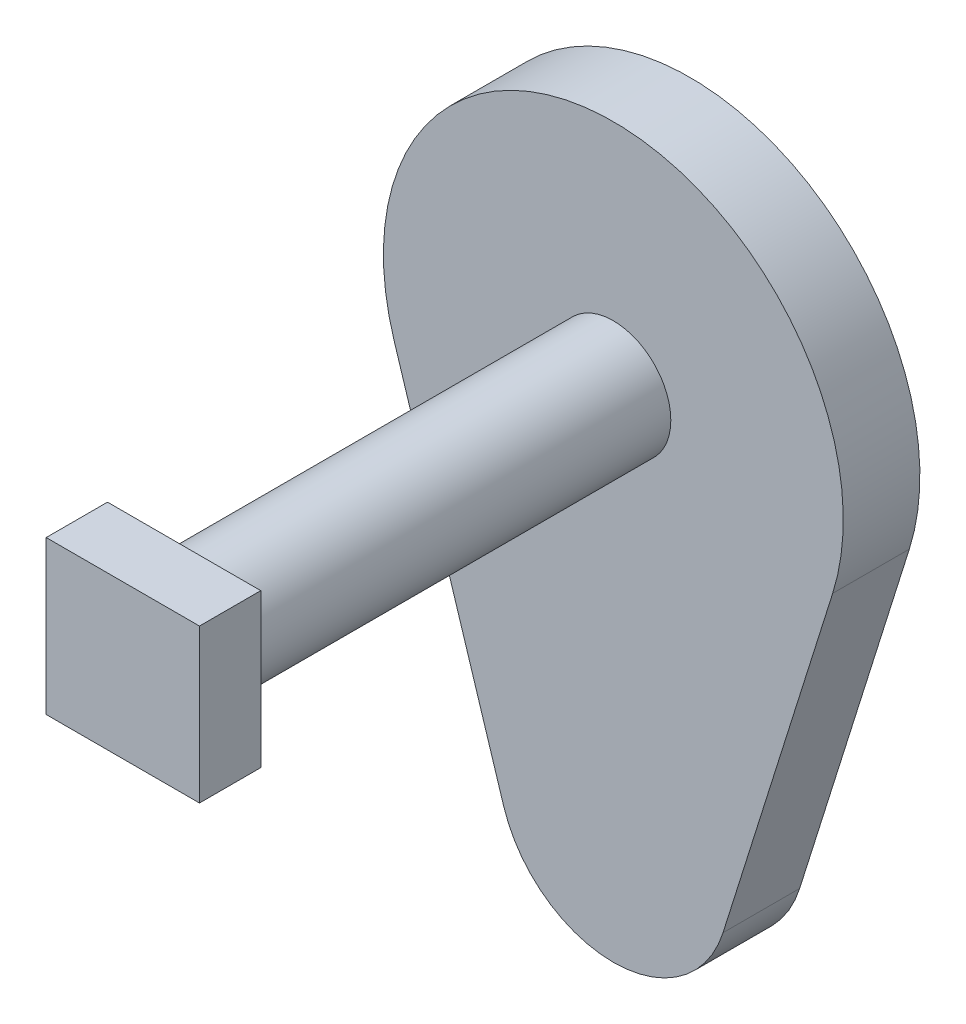
ISO-10303-21;
HEADER;
FILE_DESCRIPTION(('STEP AP214'),'2;1');
FILE_NAME('part.step','',(''),(''),'','','');
FILE_SCHEMA(('AUTOMOTIVE_DESIGN { 1 0 10303 214 1 1 1 1 }'));
ENDSEC;
DATA;
#1=APPLICATION_CONTEXT('core data for automotive mechanical design processes');
#2=APPLICATION_PROTOCOL_DEFINITION('international standard','automotive_design',2000,#1);
#3=PRODUCT_CONTEXT('',#1,'mechanical');
#4=PRODUCT('Part','Part','',(#3));
#5=PRODUCT_RELATED_PRODUCT_CATEGORY('part','',(#4));
#6=PRODUCT_DEFINITION_FORMATION('','',#4);
#7=PRODUCT_DEFINITION_CONTEXT('part definition',#1,'design');
#8=PRODUCT_DEFINITION('design','',#6,#7);
#9=PRODUCT_DEFINITION_SHAPE('','',#8);
#10=(LENGTH_UNIT() NAMED_UNIT(*) SI_UNIT(.MILLI.,.METRE.));
#11=(NAMED_UNIT(*) PLANE_ANGLE_UNIT() SI_UNIT($,.RADIAN.));
#12=(NAMED_UNIT(*) SI_UNIT($,.STERADIAN.) SOLID_ANGLE_UNIT());
#13=UNCERTAINTY_MEASURE_WITH_UNIT(LENGTH_MEASURE(1.E-05),#10,'distance_accuracy_value','');
#14=(GEOMETRIC_REPRESENTATION_CONTEXT(3) GLOBAL_UNCERTAINTY_ASSIGNED_CONTEXT((#13)) GLOBAL_UNIT_ASSIGNED_CONTEXT((#10,
#11,#12)) REPRESENTATION_CONTEXT('',''));
#15=CARTESIAN_POINT('',(0.,0.,0.));
#16=DIRECTION('',(0.,0.,1.));
#17=DIRECTION('',(1.,0.,0.));
#18=AXIS2_PLACEMENT_3D('',#15,#16,#17);
#19=CARTESIAN_POINT('',(-3.66720542821497E-11,50.,10.));
#20=DIRECTION('',(0.,0.,-1.));
#21=DIRECTION('',(-1.,0.,0.));
#22=AXIS2_PLACEMENT_3D('',#19,#20,#21);
#23=CYLINDRICAL_SURFACE('',#22,30.);
#24=CARTESIAN_POINT('',(-3.66720542821497E-11,50.,0.));
#25=DIRECTION('',(0.,0.,1.));
#26=DIRECTION('',(1.,0.,0.));
#27=AXIS2_PLACEMENT_3D('',#24,#25,#26);
#28=CIRCLE('',#27,30.);
#29=CARTESIAN_POINT('',(28.6181760424783,41.000000000021,0.));
#30=VERTEX_POINT('',#29);
#31=CARTESIAN_POINT('',(-28.6181760425384,40.999999999979,0.));
#32=VERTEX_POINT('',#31);
#33=EDGE_CURVE('E140',#30,#32,#28,.T.);
#34=ORIENTED_EDGE('',*,*,#33,.T.);
#35=DIRECTION('',(0.,0.,-1.));
#36=VECTOR('',#35,1.);
#37=CARTESIAN_POINT('',(-28.6181760425384,40.999999999979,10.));
#38=LINE('',#37,#36);
#39=CARTESIAN_POINT('',(-28.6181760425384,40.999999999979,10.));
#40=VERTEX_POINT('',#39);
#41=EDGE_CURVE('E39',#40,#32,#38,.T.);
#42=ORIENTED_EDGE('',*,*,#41,.F.);
#43=CARTESIAN_POINT('',(-3.66720542821497E-11,50.,10.));
#44=DIRECTION('',(0.,0.,1.));
#45=DIRECTION('',(1.,0.,0.));
#46=AXIS2_PLACEMENT_3D('',#43,#44,#45);
#47=CIRCLE('',#46,30.);
#48=CARTESIAN_POINT('',(28.6181760424783,41.000000000021,10.));
#49=VERTEX_POINT('',#48);
#50=EDGE_CURVE('E146',#49,#40,#47,.T.);
#51=ORIENTED_EDGE('',*,*,#50,.F.);
#52=DIRECTION('',(0.,0.,-1.));
#53=VECTOR('',#52,1.);
#54=CARTESIAN_POINT('',(28.6181760424783,41.000000000021,10.));
#55=LINE('',#54,#53);
#56=EDGE_CURVE('E152',#49,#30,#55,.T.);
#57=ORIENTED_EDGE('',*,*,#56,.T.);
#58=EDGE_LOOP('',(#34,#42,#51,#57));
#59=FACE_BOUND('',#58,.T.);
#60=ADVANCED_FACE('F36',(#59),#23,.T.);
#61=CARTESIAN_POINT('',(-28.6181760425384,40.999999999979,10.));
#62=DIRECTION('',(0.953939201416726,0.3000000000007,0.));
#63=DIRECTION('',(-0.3000000000007,0.953939201416726,0.));
#64=AXIS2_PLACEMENT_3D('',#61,#62,#63);
#65=PLANE('',#64);
#66=DIRECTION('',(0.3000000000007,-0.953939201416726,0.));
#67=VECTOR('',#66,1.);
#68=CARTESIAN_POINT('',(-28.6181760425384,40.999999999979,0.));
#69=LINE('',#68,#67);
#70=CARTESIAN_POINT('',(-14.3090880212509,-4.50000000001049,0.));
#71=VERTEX_POINT('',#70);
#72=EDGE_CURVE('E155',#32,#71,#69,.T.);
#73=ORIENTED_EDGE('',*,*,#72,.T.);
#74=DIRECTION('',(0.,0.,-1.));
#75=VECTOR('',#74,1.);
#76=CARTESIAN_POINT('',(-14.3090880212509,-4.50000000001049,10.));
#77=LINE('',#76,#75);
#78=CARTESIAN_POINT('',(-14.3090880212509,-4.50000000001049,10.));
#79=VERTEX_POINT('',#78);
#80=EDGE_CURVE('E161',#79,#71,#77,.T.);
#81=ORIENTED_EDGE('',*,*,#80,.F.);
#82=DIRECTION('',(0.3000000000007,-0.953939201416726,0.));
#83=VECTOR('',#82,1.);
#84=CARTESIAN_POINT('',(-28.6181760425384,40.999999999979,10.));
#85=LINE('',#84,#83);
#86=EDGE_CURVE('E85',#40,#79,#85,.T.);
#87=ORIENTED_EDGE('',*,*,#86,.F.);
#88=ORIENTED_EDGE('',*,*,#41,.T.);
#89=EDGE_LOOP('',(#73,#81,#87,#88));
#90=FACE_BOUND('',#89,.T.);
#91=ADVANCED_FACE('F164',(#90),#65,.F.);
#92=CARTESIAN_POINT('',(0.,0.,10.));
#93=DIRECTION('',(0.,0.,-1.));
#94=DIRECTION('',(-1.,0.,0.));
#95=AXIS2_PLACEMENT_3D('',#92,#93,#94);
#96=CYLINDRICAL_SURFACE('',#95,15.);
#97=CARTESIAN_POINT('',(0.,0.,0.));
#98=DIRECTION('',(0.,0.,1.));
#99=DIRECTION('',(1.,0.,0.));
#100=AXIS2_PLACEMENT_3D('',#97,#98,#99);
#101=CIRCLE('',#100,15.);
#102=CARTESIAN_POINT('',(14.3090880212575,-4.49999999998951,0.));
#103=VERTEX_POINT('',#102);
#104=EDGE_CURVE('E71',#71,#103,#101,.T.);
#105=ORIENTED_EDGE('',*,*,#104,.T.);
#106=DIRECTION('',(0.,0.,-1.));
#107=VECTOR('',#106,1.);
#108=CARTESIAN_POINT('',(14.3090880212575,-4.49999999998951,10.));
#109=LINE('',#108,#107);
#110=CARTESIAN_POINT('',(14.3090880212575,-4.49999999998951,10.));
#111=VERTEX_POINT('',#110);
#112=EDGE_CURVE('E160',#111,#103,#109,.T.);
#113=ORIENTED_EDGE('',*,*,#112,.F.);
#114=CARTESIAN_POINT('',(0.,0.,10.));
#115=DIRECTION('',(0.,0.,1.));
#116=DIRECTION('',(1.,0.,0.));
#117=AXIS2_PLACEMENT_3D('',#114,#115,#116);
#118=CIRCLE('',#117,15.);
#119=EDGE_CURVE('E149',#79,#111,#118,.T.);
#120=ORIENTED_EDGE('',*,*,#119,.F.);
#121=ORIENTED_EDGE('',*,*,#80,.T.);
#122=EDGE_LOOP('',(#105,#113,#120,#121));
#123=FACE_BOUND('',#122,.T.);
#124=ADVANCED_FACE('F188',(#123),#96,.T.);
#125=CARTESIAN_POINT('',(28.6181760424783,41.000000000021,10.));
#126=DIRECTION('',(-0.953939201417166,0.2999999999993,0.));
#127=DIRECTION('',(-0.2999999999993,-0.953939201417166,0.));
#128=AXIS2_PLACEMENT_3D('',#125,#126,#127);
#129=PLANE('',#128);
#130=DIRECTION('',(0.2999999999993,0.953939201417166,0.));
#131=VECTOR('',#130,1.);
#132=CARTESIAN_POINT('',(28.6181760424783,41.000000000021,0.));
#133=LINE('',#132,#131);
#134=EDGE_CURVE('E77',#103,#30,#133,.T.);
#135=ORIENTED_EDGE('',*,*,#134,.T.);
#136=ORIENTED_EDGE('',*,*,#56,.F.);
#137=DIRECTION('',(0.2999999999993,0.953939201417166,0.));
#138=VECTOR('',#137,1.);
#139=CARTESIAN_POINT('',(28.6181760424783,41.000000000021,10.));
#140=LINE('',#139,#138);
#141=EDGE_CURVE('E53',#111,#49,#140,.T.);
#142=ORIENTED_EDGE('',*,*,#141,.F.);
#143=ORIENTED_EDGE('',*,*,#112,.T.);
#144=EDGE_LOOP('',(#135,#136,#142,#143));
#145=FACE_BOUND('',#144,.T.);
#146=ADVANCED_FACE('F180',(#145),#129,.F.);
#147=CARTESIAN_POINT('',(-3.66720542821497E-11,50.,10.));
#148=DIRECTION('',(0.,0.,1.));
#149=DIRECTION('',(1.,0.,0.));
#150=AXIS2_PLACEMENT_3D('',#147,#148,#149);
#151=PLANE('',#150);
#152=CARTESIAN_POINT('',(-3.66720542821497E-11,50.,10.));
#153=DIRECTION('',(0.,0.,1.));
#154=DIRECTION('',(1.,0.,0.));
#155=AXIS2_PLACEMENT_3D('',#152,#153,#154);
#156=CIRCLE('',#155,7.5);
#157=CARTESIAN_POINT('',(7.49999999996333,50.,10.));
#158=VERTEX_POINT('',#157);
#159=EDGE_CURVE('E11',#158,#158,#156,.T.);
#160=ORIENTED_EDGE('',*,*,#159,.F.);
#161=EDGE_LOOP('',(#160));
#162=FACE_BOUND('',#161,.T.);
#163=ORIENTED_EDGE('',*,*,#50,.T.);
#164=ORIENTED_EDGE('',*,*,#86,.T.);
#165=ORIENTED_EDGE('',*,*,#119,.T.);
#166=ORIENTED_EDGE('',*,*,#141,.T.);
#167=EDGE_LOOP('',(#163,#164,#165,#166));
#168=FACE_BOUND('',#167,.T.);
#169=ADVANCED_FACE('F172',(#162,#168),#151,.T.);
#170=CARTESIAN_POINT('',(-3.66720542821497E-11,50.,0.));
#171=DIRECTION('',(0.,0.,1.));
#172=DIRECTION('',(1.,0.,0.));
#173=AXIS2_PLACEMENT_3D('',#170,#171,#172);
#174=PLANE('',#173);
#175=ORIENTED_EDGE('',*,*,#33,.F.);
#176=ORIENTED_EDGE('',*,*,#134,.F.);
#177=ORIENTED_EDGE('',*,*,#104,.F.);
#178=ORIENTED_EDGE('',*,*,#72,.F.);
#179=EDGE_LOOP('',(#175,#176,#177,#178));
#180=FACE_BOUND('',#179,.T.);
#181=ADVANCED_FACE('F169',(#180),#174,.F.);
#182=CARTESIAN_POINT('',(-3.66720542821497E-11,50.,66.));
#183=DIRECTION('',(0.,0.,-1.));
#184=DIRECTION('',(-1.,0.,0.));
#185=AXIS2_PLACEMENT_3D('',#182,#183,#184);
#186=CYLINDRICAL_SURFACE('',#185,7.5);
#187=CARTESIAN_POINT('',(-3.66720542821497E-11,50.,66.));
#188=DIRECTION('',(0.,0.,1.));
#189=DIRECTION('',(1.,0.,0.));
#190=AXIS2_PLACEMENT_3D('',#187,#188,#189);
#191=CIRCLE('',#190,7.5);
#192=CARTESIAN_POINT('',(7.49999999996333,50.,66.));
#193=VERTEX_POINT('',#192);
#194=EDGE_CURVE('E137',#193,#193,#191,.T.);
#195=ORIENTED_EDGE('',*,*,#194,.F.);
#196=EDGE_LOOP('',(#195));
#197=FACE_BOUND('',#196,.T.);
#198=ORIENTED_EDGE('',*,*,#159,.T.);
#199=EDGE_LOOP('',(#198));
#200=FACE_BOUND('',#199,.T.);
#201=ADVANCED_FACE('F171',(#197,#200),#186,.T.);
#202=CARTESIAN_POINT('',(9.99999999996333,40.,74.));
#203=DIRECTION('',(-1.,0.,0.));
#204=DIRECTION('',(0.,0.,1.));
#205=AXIS2_PLACEMENT_3D('',#202,#203,#204);
#206=PLANE('',#205);
#207=DIRECTION('',(0.,1.,0.));
#208=VECTOR('',#207,1.);
#209=CARTESIAN_POINT('',(9.99999999996333,40.,66.));
#210=LINE('',#209,#208);
#211=CARTESIAN_POINT('',(9.99999999996333,40.,66.));
#212=VERTEX_POINT('',#211);
#213=CARTESIAN_POINT('',(9.99999999996333,60.,66.));
#214=VERTEX_POINT('',#213);
#215=EDGE_CURVE('E136',#212,#214,#210,.T.);
#216=ORIENTED_EDGE('',*,*,#215,.T.);
#217=DIRECTION('',(0.,0.,-1.));
#218=VECTOR('',#217,1.);
#219=CARTESIAN_POINT('',(9.99999999996333,60.,74.));
#220=LINE('',#219,#218);
#221=CARTESIAN_POINT('',(9.99999999996333,60.,74.));
#222=VERTEX_POINT('',#221);
#223=EDGE_CURVE('E116',#222,#214,#220,.T.);
#224=ORIENTED_EDGE('',*,*,#223,.F.);
#225=DIRECTION('',(0.,1.,0.));
#226=VECTOR('',#225,1.);
#227=CARTESIAN_POINT('',(9.99999999996333,40.,74.));
#228=LINE('',#227,#226);
#229=CARTESIAN_POINT('',(9.99999999996333,40.,74.));
#230=VERTEX_POINT('',#229);
#231=EDGE_CURVE('E123',#230,#222,#228,.T.);
#232=ORIENTED_EDGE('',*,*,#231,.F.);
#233=DIRECTION('',(0.,0.,-1.));
#234=VECTOR('',#233,1.);
#235=CARTESIAN_POINT('',(9.99999999996333,40.,74.));
#236=LINE('',#235,#234);
#237=EDGE_CURVE('E281',#230,#212,#236,.T.);
#238=ORIENTED_EDGE('',*,*,#237,.T.);
#239=EDGE_LOOP('',(#216,#224,#232,#238));
#240=FACE_BOUND('',#239,.T.);
#241=ADVANCED_FACE('F134',(#240),#206,.F.);
#242=CARTESIAN_POINT('',(-10.0000000000367,60.,74.));
#243=DIRECTION('',(0.,-1.,0.));
#244=DIRECTION('',(0.,0.,-1.));
#245=AXIS2_PLACEMENT_3D('',#242,#243,#244);
#246=PLANE('',#245);
#247=DIRECTION('',(-1.,0.,0.));
#248=VECTOR('',#247,1.);
#249=CARTESIAN_POINT('',(-10.0000000000367,60.,66.));
#250=LINE('',#249,#248);
#251=CARTESIAN_POINT('',(-10.0000000000367,60.,66.));
#252=VERTEX_POINT('',#251);
#253=EDGE_CURVE('E272',#214,#252,#250,.T.);
#254=ORIENTED_EDGE('',*,*,#253,.T.);
#255=DIRECTION('',(0.,0.,-1.));
#256=VECTOR('',#255,1.);
#257=CARTESIAN_POINT('',(-10.0000000000367,60.,74.));
#258=LINE('',#257,#256);
#259=CARTESIAN_POINT('',(-10.0000000000367,60.,74.));
#260=VERTEX_POINT('',#259);
#261=EDGE_CURVE('E119',#260,#252,#258,.T.);
#262=ORIENTED_EDGE('',*,*,#261,.F.);
#263=DIRECTION('',(-1.,0.,0.));
#264=VECTOR('',#263,1.);
#265=CARTESIAN_POINT('',(-10.0000000000367,60.,74.));
#266=LINE('',#265,#264);
#267=EDGE_CURVE('E112',#222,#260,#266,.T.);
#268=ORIENTED_EDGE('',*,*,#267,.F.);
#269=ORIENTED_EDGE('',*,*,#223,.T.);
#270=EDGE_LOOP('',(#254,#262,#268,#269));
#271=FACE_BOUND('',#270,.T.);
#272=ADVANCED_FACE('F114',(#271),#246,.F.);
#273=CARTESIAN_POINT('',(-10.0000000000367,40.,74.));
#274=DIRECTION('',(1.,0.,0.));
#275=DIRECTION('',(0.,0.,-1.));
#276=AXIS2_PLACEMENT_3D('',#273,#274,#275);
#277=PLANE('',#276);
#278=DIRECTION('',(0.,-1.,0.));
#279=VECTOR('',#278,1.);
#280=CARTESIAN_POINT('',(-10.0000000000367,40.,66.));
#281=LINE('',#280,#279);
#282=CARTESIAN_POINT('',(-10.0000000000367,40.,66.));
#283=VERTEX_POINT('',#282);
#284=EDGE_CURVE('E274',#252,#283,#281,.T.);
#285=ORIENTED_EDGE('',*,*,#284,.T.);
#286=DIRECTION('',(0.,0.,-1.));
#287=VECTOR('',#286,1.);
#288=CARTESIAN_POINT('',(-10.0000000000367,40.,74.));
#289=LINE('',#288,#287);
#290=CARTESIAN_POINT('',(-10.0000000000367,40.,74.));
#291=VERTEX_POINT('',#290);
#292=EDGE_CURVE('E142',#291,#283,#289,.T.);
#293=ORIENTED_EDGE('',*,*,#292,.F.);
#294=DIRECTION('',(0.,-1.,0.));
#295=VECTOR('',#294,1.);
#296=CARTESIAN_POINT('',(-10.0000000000367,40.,74.));
#297=LINE('',#296,#295);
#298=EDGE_CURVE('E122',#260,#291,#297,.T.);
#299=ORIENTED_EDGE('',*,*,#298,.F.);
#300=ORIENTED_EDGE('',*,*,#261,.T.);
#301=EDGE_LOOP('',(#285,#293,#299,#300));
#302=FACE_BOUND('',#301,.T.);
#303=ADVANCED_FACE('F227',(#302),#277,.F.);
#304=CARTESIAN_POINT('',(-10.0000000000367,40.,74.));
#305=DIRECTION('',(0.,1.,0.));
#306=DIRECTION('',(0.,0.,1.));
#307=AXIS2_PLACEMENT_3D('',#304,#305,#306);
#308=PLANE('',#307);
#309=DIRECTION('',(1.,0.,0.));
#310=VECTOR('',#309,1.);
#311=CARTESIAN_POINT('',(-10.0000000000367,40.,66.));
#312=LINE('',#311,#310);
#313=EDGE_CURVE('E132',#283,#212,#312,.T.);
#314=ORIENTED_EDGE('',*,*,#313,.T.);
#315=ORIENTED_EDGE('',*,*,#237,.F.);
#316=DIRECTION('',(1.,0.,0.));
#317=VECTOR('',#316,1.);
#318=CARTESIAN_POINT('',(-10.0000000000367,40.,74.));
#319=LINE('',#318,#317);
#320=EDGE_CURVE('E128',#291,#230,#319,.T.);
#321=ORIENTED_EDGE('',*,*,#320,.F.);
#322=ORIENTED_EDGE('',*,*,#292,.T.);
#323=EDGE_LOOP('',(#314,#315,#321,#322));
#324=FACE_BOUND('',#323,.T.);
#325=ADVANCED_FACE('F236',(#324),#308,.F.);
#326=CARTESIAN_POINT('',(0.,0.,74.));
#327=DIRECTION('',(0.,0.,-1.));
#328=DIRECTION('',(-1.,0.,0.));
#329=AXIS2_PLACEMENT_3D('',#326,#327,#328);
#330=PLANE('',#329);
#331=ORIENTED_EDGE('',*,*,#231,.T.);
#332=ORIENTED_EDGE('',*,*,#267,.T.);
#333=ORIENTED_EDGE('',*,*,#298,.T.);
#334=ORIENTED_EDGE('',*,*,#320,.T.);
#335=EDGE_LOOP('',(#331,#332,#333,#334));
#336=FACE_BOUND('',#335,.T.);
#337=ADVANCED_FACE('F126',(#336),#330,.F.);
#338=CARTESIAN_POINT('',(0.,0.,66.));
#339=DIRECTION('',(0.,0.,-1.));
#340=DIRECTION('',(-1.,0.,0.));
#341=AXIS2_PLACEMENT_3D('',#338,#339,#340);
#342=PLANE('',#341);
#343=ORIENTED_EDGE('',*,*,#194,.T.);
#344=EDGE_LOOP('',(#343));
#345=FACE_BOUND('',#344,.T.);
#346=ORIENTED_EDGE('',*,*,#215,.F.);
#347=ORIENTED_EDGE('',*,*,#313,.F.);
#348=ORIENTED_EDGE('',*,*,#284,.F.);
#349=ORIENTED_EDGE('',*,*,#253,.F.);
#350=EDGE_LOOP('',(#346,#347,#348,#349));
#351=FACE_BOUND('',#350,.T.);
#352=ADVANCED_FACE('F255',(#345,#351),#342,.T.);
#353=CLOSED_SHELL('',(#60,#91,#124,#146,#169,#181,#201,#241,#272,#303,#325,#337,#352));
#354=MANIFOLD_SOLID_BREP('B2',#353);
#355=ADVANCED_BREP_SHAPE_REPRESENTATION('',(#18,#354),#14);
#356=SHAPE_DEFINITION_REPRESENTATION(#9,#355);
ENDSEC;
END-ISO-10303-21;
